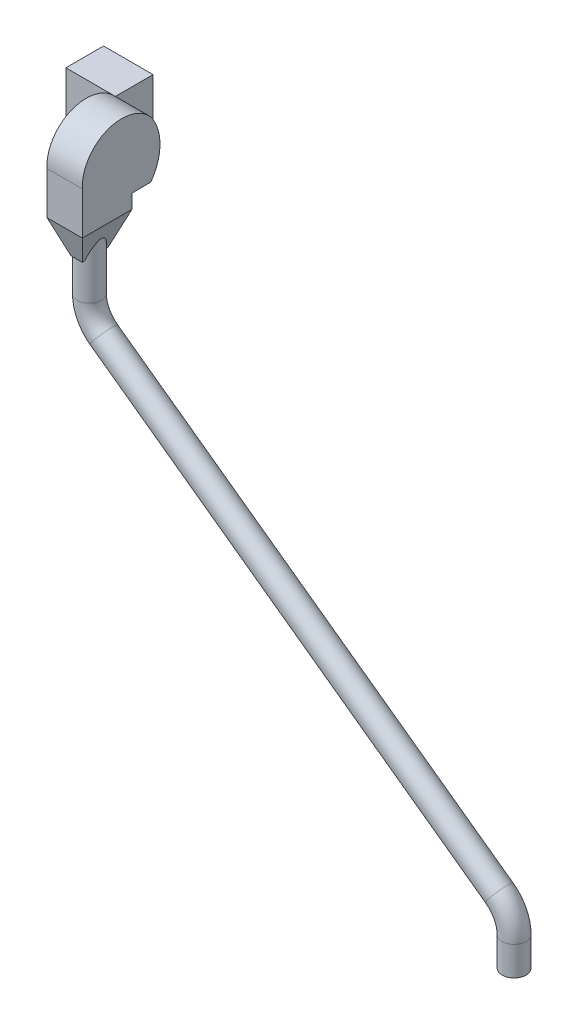
ISO-10303-21;
HEADER;
FILE_DESCRIPTION(('STEP AP214'),'2;1');
FILE_NAME('part.step','',(''),(''),'','','');
FILE_SCHEMA(('AUTOMOTIVE_DESIGN { 1 0 10303 214 1 1 1 1 }'));
ENDSEC;
DATA;
#1=APPLICATION_CONTEXT('core data for automotive mechanical design processes');
#2=APPLICATION_PROTOCOL_DEFINITION('international standard','automotive_design',2000,#1);
#3=PRODUCT_CONTEXT('',#1,'mechanical');
#4=PRODUCT('Part','Part','',(#3));
#5=PRODUCT_RELATED_PRODUCT_CATEGORY('part','',(#4));
#6=PRODUCT_DEFINITION_FORMATION('','',#4);
#7=PRODUCT_DEFINITION_CONTEXT('part definition',#1,'design');
#8=PRODUCT_DEFINITION('design','',#6,#7);
#9=PRODUCT_DEFINITION_SHAPE('','',#8);
#10=(LENGTH_UNIT() NAMED_UNIT(*) SI_UNIT(.MILLI.,.METRE.));
#11=(NAMED_UNIT(*) PLANE_ANGLE_UNIT() SI_UNIT($,.RADIAN.));
#12=(NAMED_UNIT(*) SI_UNIT($,.STERADIAN.) SOLID_ANGLE_UNIT());
#13=UNCERTAINTY_MEASURE_WITH_UNIT(LENGTH_MEASURE(1.E-05),#10,'distance_accuracy_value','');
#14=(GEOMETRIC_REPRESENTATION_CONTEXT(3) GLOBAL_UNCERTAINTY_ASSIGNED_CONTEXT((#13)) GLOBAL_UNIT_ASSIGNED_CONTEXT((#10,
#11,#12)) REPRESENTATION_CONTEXT('',''));
#15=CARTESIAN_POINT('',(0.,0.,0.));
#16=DIRECTION('',(0.,0.,1.));
#17=DIRECTION('',(1.,0.,0.));
#18=AXIS2_PLACEMENT_3D('',#15,#16,#17);
#19=CARTESIAN_POINT('',(255.,-120.,160.));
#20=DIRECTION('',(0.,1.,0.));
#21=DIRECTION('',(0.,0.,1.));
#22=AXIS2_PLACEMENT_3D('',#19,#20,#21);
#23=PLANE('',#22);
#24=DIRECTION('',(1.,0.,0.));
#25=VECTOR('',#24,1.);
#26=CARTESIAN_POINT('',(255.,-120.,239.857858587835));
#27=LINE('',#26,#25);
#28=CARTESIAN_POINT('',(105.,-120.,239.857858587835));
#29=VERTEX_POINT('',#28);
#30=CARTESIAN_POINT('',(255.,-120.,239.857858587835));
#31=VERTEX_POINT('',#30);
#32=EDGE_CURVE('E141',#29,#31,#27,.T.);
#33=ORIENTED_EDGE('',*,*,#32,.F.);
#34=DIRECTION('',(0.,0.,-1.));
#35=VECTOR('',#34,1.);
#36=CARTESIAN_POINT('',(105.,-120.,160.));
#37=LINE('',#36,#35);
#38=CARTESIAN_POINT('',(105.,-120.,160.));
#39=VERTEX_POINT('',#38);
#40=EDGE_CURVE('E187',#29,#39,#37,.T.);
#41=ORIENTED_EDGE('',*,*,#40,.T.);
#42=DIRECTION('',(-1.,0.,0.));
#43=VECTOR('',#42,1.);
#44=CARTESIAN_POINT('',(255.,-120.,160.));
#45=LINE('',#44,#43);
#46=CARTESIAN_POINT('',(255.,-120.,160.));
#47=VERTEX_POINT('',#46);
#48=EDGE_CURVE('E193',#47,#39,#45,.T.);
#49=ORIENTED_EDGE('',*,*,#48,.F.);
#50=DIRECTION('',(0.,0.,-1.));
#51=VECTOR('',#50,1.);
#52=CARTESIAN_POINT('',(255.,-120.,160.));
#53=LINE('',#52,#51);
#54=EDGE_CURVE('E191',#31,#47,#53,.T.);
#55=ORIENTED_EDGE('',*,*,#54,.F.);
#56=EDGE_LOOP('',(#33,#41,#49,#55));
#57=FACE_BOUND('',#56,.T.);
#58=ADVANCED_FACE('F44',(#57),#23,.F.);
#59=CARTESIAN_POINT('',(255.,0.,324.123215286529));
#60=DIRECTION('',(-1.,0.,0.));
#61=DIRECTION('',(0.,0.,1.));
#62=AXIS2_PLACEMENT_3D('',#59,#60,#61);
#63=CYLINDRICAL_SURFACE('',#62,203.31362422619);
#64=CARTESIAN_POINT('',(105.,0.,324.123215286529));
#65=DIRECTION('',(1.,0.,0.));
#66=DIRECTION('',(0.,0.,-1.));
#67=AXIS2_PLACEMENT_3D('',#64,#65,#66);
#68=CIRCLE('',#67,203.31362422619);
#69=CARTESIAN_POINT('',(105.,120.,160.));
#70=VERTEX_POINT('',#69);
#71=EDGE_CURVE('E182',#39,#70,#68,.T.);
#72=ORIENTED_EDGE('',*,*,#71,.T.);
#73=DIRECTION('',(-1.,0.,0.));
#74=VECTOR('',#73,1.);
#75=CARTESIAN_POINT('',(255.,120.,160.));
#76=LINE('',#75,#74);
#77=CARTESIAN_POINT('',(255.,120.,160.));
#78=VERTEX_POINT('',#77);
#79=EDGE_CURVE('E207',#78,#70,#76,.T.);
#80=ORIENTED_EDGE('',*,*,#79,.F.);
#81=CARTESIAN_POINT('',(255.,0.,324.123215286529));
#82=DIRECTION('',(1.,0.,0.));
#83=DIRECTION('',(0.,0.,-1.));
#84=AXIS2_PLACEMENT_3D('',#81,#82,#83);
#85=CIRCLE('',#84,203.31362422619);
#86=EDGE_CURVE('E183',#47,#78,#85,.T.);
#87=ORIENTED_EDGE('',*,*,#86,.F.);
#88=ORIENTED_EDGE('',*,*,#48,.T.);
#89=EDGE_LOOP('',(#72,#80,#87,#88));
#90=FACE_BOUND('',#89,.T.);
#91=ADVANCED_FACE('F46',(#90),#63,.T.);
#92=CARTESIAN_POINT('',(255.,8.53871556863522,283.705675407711));
#93=DIRECTION('',(-1.,0.,0.));
#94=DIRECTION('',(0.,0.,1.));
#95=AXIS2_PLACEMENT_3D('',#92,#93,#94);
#96=CYLINDRICAL_SURFACE('',#95,166.513399025927);
#97=CARTESIAN_POINT('',(105.,8.53871556863522,283.705675407711));
#98=DIRECTION('',(1.,0.,0.));
#99=DIRECTION('',(0.,0.,1.));
#100=AXIS2_PLACEMENT_3D('',#97,#98,#99);
#101=CIRCLE('',#100,166.513399025927);
#102=CARTESIAN_POINT('',(105.,0.,450.));
#103=VERTEX_POINT('',#102);
#104=EDGE_CURVE('E196',#70,#103,#101,.T.);
#105=ORIENTED_EDGE('',*,*,#104,.T.);
#106=DIRECTION('',(-1.,0.,0.));
#107=VECTOR('',#106,1.);
#108=CARTESIAN_POINT('',(255.,0.,450.));
#109=LINE('',#108,#107);
#110=CARTESIAN_POINT('',(255.,0.,450.));
#111=VERTEX_POINT('',#110);
#112=EDGE_CURVE('E204',#111,#103,#109,.T.);
#113=ORIENTED_EDGE('',*,*,#112,.F.);
#114=CARTESIAN_POINT('',(255.,8.53871556863522,283.705675407711));
#115=DIRECTION('',(1.,0.,0.));
#116=DIRECTION('',(0.,0.,1.));
#117=AXIS2_PLACEMENT_3D('',#114,#115,#116);
#118=CIRCLE('',#117,166.513399025927);
#119=EDGE_CURVE('E186',#78,#111,#118,.T.);
#120=ORIENTED_EDGE('',*,*,#119,.F.);
#121=ORIENTED_EDGE('',*,*,#79,.T.);
#122=EDGE_LOOP('',(#105,#113,#120,#121));
#123=FACE_BOUND('',#122,.T.);
#124=ADVANCED_FACE('F238',(#123),#96,.T.);
#125=CARTESIAN_POINT('',(255.,-120.,450.));
#126=DIRECTION('',(0.,0.,-1.));
#127=DIRECTION('',(-1.,0.,0.));
#128=AXIS2_PLACEMENT_3D('',#125,#126,#127);
#129=PLANE('',#128);
#130=DIRECTION('',(0.,-1.,0.));
#131=VECTOR('',#130,1.);
#132=CARTESIAN_POINT('',(105.,-120.,450.));
#133=LINE('',#132,#131);
#134=CARTESIAN_POINT('',(105.,-180.,450.));
#135=VERTEX_POINT('',#134);
#136=EDGE_CURVE('E198',#103,#135,#133,.T.);
#137=ORIENTED_EDGE('',*,*,#136,.T.);
#138=DIRECTION('',(-1.,0.,0.));
#139=VECTOR('',#138,1.);
#140=CARTESIAN_POINT('',(105.,-180.,450.));
#141=LINE('',#140,#139);
#142=CARTESIAN_POINT('',(255.,-180.,450.));
#143=VERTEX_POINT('',#142);
#144=EDGE_CURVE('E171',#143,#135,#141,.T.);
#145=ORIENTED_EDGE('',*,*,#144,.F.);
#146=DIRECTION('',(0.,-1.,0.));
#147=VECTOR('',#146,1.);
#148=CARTESIAN_POINT('',(255.,-120.,450.));
#149=LINE('',#148,#147);
#150=EDGE_CURVE('E189',#111,#143,#149,.T.);
#151=ORIENTED_EDGE('',*,*,#150,.F.);
#152=ORIENTED_EDGE('',*,*,#112,.T.);
#153=EDGE_LOOP('',(#137,#145,#151,#152));
#154=FACE_BOUND('',#153,.T.);
#155=ADVANCED_FACE('F234',(#154),#129,.F.);
#156=CARTESIAN_POINT('',(255.,0.,324.123215286529));
#157=DIRECTION('',(1.,0.,0.));
#158=DIRECTION('',(0.,0.,-1.));
#159=AXIS2_PLACEMENT_3D('',#156,#157,#158);
#160=PLANE('',#159);
#161=ORIENTED_EDGE('',*,*,#86,.T.);
#162=ORIENTED_EDGE('',*,*,#119,.T.);
#163=ORIENTED_EDGE('',*,*,#150,.T.);
#164=DIRECTION('',(0.,0.,1.));
#165=VECTOR('',#164,1.);
#166=CARTESIAN_POINT('',(255.,-180.,450.));
#167=LINE('',#166,#165);
#168=CARTESIAN_POINT('',(255.,-180.,239.857858587835));
#169=VERTEX_POINT('',#168);
#170=EDGE_CURVE('E168',#169,#143,#167,.T.);
#171=ORIENTED_EDGE('',*,*,#170,.F.);
#172=DIRECTION('',(0.,1.,0.));
#173=VECTOR('',#172,1.);
#174=CARTESIAN_POINT('',(255.,-180.,239.857858587835));
#175=LINE('',#174,#173);
#176=EDGE_CURVE('E174',#169,#31,#175,.T.);
#177=ORIENTED_EDGE('',*,*,#176,.T.);
#178=ORIENTED_EDGE('',*,*,#54,.T.);
#179=EDGE_LOOP('',(#161,#162,#163,#171,#177,#178));
#180=FACE_BOUND('',#179,.T.);
#181=ADVANCED_FACE('F248',(#180),#160,.T.);
#182=CARTESIAN_POINT('',(105.,0.,324.123215286529));
#183=DIRECTION('',(1.,0.,0.));
#184=DIRECTION('',(0.,0.,-1.));
#185=AXIS2_PLACEMENT_3D('',#182,#183,#184);
#186=PLANE('',#185);
#187=ORIENTED_EDGE('',*,*,#71,.F.);
#188=ORIENTED_EDGE('',*,*,#40,.F.);
#189=DIRECTION('',(0.,1.,0.));
#190=VECTOR('',#189,1.);
#191=CARTESIAN_POINT('',(105.,-180.,239.857858587835));
#192=LINE('',#191,#190);
#193=CARTESIAN_POINT('',(105.,-180.,239.857858587835));
#194=VERTEX_POINT('',#193);
#195=EDGE_CURVE('E179',#194,#29,#192,.T.);
#196=ORIENTED_EDGE('',*,*,#195,.F.);
#197=DIRECTION('',(0.,0.,-1.));
#198=VECTOR('',#197,1.);
#199=CARTESIAN_POINT('',(105.,-180.,239.857858587835));
#200=LINE('',#199,#198);
#201=EDGE_CURVE('E162',#135,#194,#200,.T.);
#202=ORIENTED_EDGE('',*,*,#201,.F.);
#203=ORIENTED_EDGE('',*,*,#136,.F.);
#204=ORIENTED_EDGE('',*,*,#104,.F.);
#205=EDGE_LOOP('',(#187,#188,#196,#202,#203,#204));
#206=FACE_BOUND('',#205,.T.);
#207=ADVANCED_FACE('F231',(#206),#186,.F.);
#208=CARTESIAN_POINT('',(255.,-180.,239.857858587835));
#209=DIRECTION('',(0.,0.,1.));
#210=DIRECTION('',(0.,-1.,0.));
#211=AXIS2_PLACEMENT_3D('',#208,#209,#210);
#212=PLANE('',#211);
#213=ORIENTED_EDGE('',*,*,#32,.T.);
#214=ORIENTED_EDGE('',*,*,#176,.F.);
#215=DIRECTION('',(1.,0.,0.));
#216=VECTOR('',#215,1.);
#217=CARTESIAN_POINT('',(255.,-180.,239.857858587835));
#218=LINE('',#217,#216);
#219=EDGE_CURVE('E165',#194,#169,#218,.T.);
#220=ORIENTED_EDGE('',*,*,#219,.F.);
#221=ORIENTED_EDGE('',*,*,#195,.T.);
#222=EDGE_LOOP('',(#213,#214,#220,#221));
#223=FACE_BOUND('',#222,.T.);
#224=ADVANCED_FACE('F245',(#223),#212,.F.);
#225=CARTESIAN_POINT('',(0.,-320.,0.));
#226=DIRECTION('',(0.,1.,0.));
#227=DIRECTION('',(0.,0.,1.));
#228=AXIS2_PLACEMENT_3D('',#225,#226,#227);
#229=PLANE('',#228);
#230=DIRECTION('',(0.,0.,-1.));
#231=VECTOR('',#230,1.);
#232=CARTESIAN_POINT('',(204.044167202732,-320.,0.));
#233=LINE('',#232,#231);
#234=CARTESIAN_POINT('',(204.044167202732,-320.,290.813691385104));
#235=VERTEX_POINT('',#234);
#236=CARTESIAN_POINT('',(204.044167202732,-320.,300.179426240508));
#237=VERTEX_POINT('',#236);
#238=EDGE_CURVE('E158',#235,#237,#233,.F.);
#239=ORIENTED_EDGE('',*,*,#238,.T.);
#240=CARTESIAN_POINT('',(180.,-320.,344.928929293918));
#241=DIRECTION('',(0.,1.,0.));
#242=DIRECTION('',(0.,0.,1.));
#243=AXIS2_PLACEMENT_3D('',#240,#241,#242);
#244=CIRCLE('',#243,50.8);
#245=CARTESIAN_POINT('',(155.955832797268,-320.,300.179426240508));
#246=VERTEX_POINT('',#245);
#247=EDGE_CURVE('E12',#237,#246,#244,.T.);
#248=ORIENTED_EDGE('',*,*,#247,.T.);
#249=DIRECTION('',(0.,0.,1.));
#250=VECTOR('',#249,1.);
#251=CARTESIAN_POINT('',(155.955832797268,-320.,0.));
#252=LINE('',#251,#250);
#253=CARTESIAN_POINT('',(155.955832797268,-320.,290.813691385104));
#254=VERTEX_POINT('',#253);
#255=EDGE_CURVE('E137',#246,#254,#252,.F.);
#256=ORIENTED_EDGE('',*,*,#255,.T.);
#257=DIRECTION('',(-1.,0.,0.));
#258=VECTOR('',#257,1.);
#259=CARTESIAN_POINT('',(0.,-320.,290.813691385104));
#260=LINE('',#259,#258);
#261=EDGE_CURVE('E155',#254,#235,#260,.F.);
#262=ORIENTED_EDGE('',*,*,#261,.T.);
#263=EDGE_LOOP('',(#239,#248,#256,#262));
#264=FACE_BOUND('',#263,.T.);
#265=ADVANCED_FACE('F255',(#264),#229,.F.);
#266=CARTESIAN_POINT('',(105.,-180.,239.857858587835));
#267=DIRECTION('',(-0.939692620785908,-0.342020143325669,0.));
#268=DIRECTION('',(0.342020143325669,-0.939692620785908,0.));
#269=AXIS2_PLACEMENT_3D('',#266,#267,#268);
#270=PLANE('',#269);
#271=ORIENTED_EDGE('',*,*,#255,.F.);
#272=CARTESIAN_POINT('',(180.,-386.060806459097,344.928929293918));
#273=DIRECTION('',(-0.939692620785908,-0.342020143325669,0.));
#274=DIRECTION('',(-0.342020143325669,0.939692620785908,0.));
#275=AXIS2_PLACEMENT_3D('',#272,#273,#274);
#276=ELLIPSE('',#275,148.529263528285,50.8);
#277=CARTESIAN_POINT('',(155.955832797268,-320.,389.678432347327));
#278=VERTEX_POINT('',#277);
#279=EDGE_CURVE('E48',#246,#278,#276,.F.);
#280=ORIENTED_EDGE('',*,*,#279,.T.);
#281=CARTESIAN_POINT('',(155.955832797268,-320.,399.044167202732));
#282=VERTEX_POINT('',#281);
#283=EDGE_CURVE('E152',#282,#278,#252,.F.);
#284=ORIENTED_EDGE('',*,*,#283,.F.);
#285=DIRECTION('',(-0.323615577118185,0.889126490715988,0.323615577118185));
#286=VECTOR('',#285,1.);
#287=CARTESIAN_POINT('',(127.007564817849,-240.465287394225,427.992435182151));
#288=LINE('',#287,#286);
#289=EDGE_CURVE('E143',#282,#135,#288,.T.);
#290=ORIENTED_EDGE('',*,*,#289,.T.);
#291=ORIENTED_EDGE('',*,*,#201,.T.);
#292=DIRECTION('',(-0.323615577118185,0.889126490715988,-0.323615577118185));
#293=VECTOR('',#292,1.);
#294=CARTESIAN_POINT('',(120.70905626303,-223.160277363618,255.566914850866));
#295=LINE('',#294,#293);
#296=EDGE_CURVE('E138',#254,#194,#295,.T.);
#297=ORIENTED_EDGE('',*,*,#296,.F.);
#298=EDGE_LOOP('',(#271,#280,#284,#290,#291,#297));
#299=FACE_BOUND('',#298,.T.);
#300=ADVANCED_FACE('F217',(#299),#270,.T.);
#301=CARTESIAN_POINT('',(255.,-180.,239.857858587835));
#302=DIRECTION('',(0.,-0.342020143325669,-0.939692620785908));
#303=DIRECTION('',(0.,0.939692620785908,-0.342020143325669));
#304=AXIS2_PLACEMENT_3D('',#301,#302,#303);
#305=PLANE('',#304);
#306=ORIENTED_EDGE('',*,*,#219,.T.);
#307=DIRECTION('',(0.323615577118185,0.889126490715988,-0.323615577118185));
#308=VECTOR('',#307,1.);
#309=CARTESIAN_POINT('',(232.992435182151,-240.465287394225,261.865423405684));
#310=LINE('',#309,#308);
#311=EDGE_CURVE('E142',#235,#169,#310,.T.);
#312=ORIENTED_EDGE('',*,*,#311,.F.);
#313=ORIENTED_EDGE('',*,*,#261,.F.);
#314=ORIENTED_EDGE('',*,*,#296,.T.);
#315=EDGE_LOOP('',(#306,#312,#313,#314));
#316=FACE_BOUND('',#315,.T.);
#317=ADVANCED_FACE('F251',(#316),#305,.T.);
#318=CARTESIAN_POINT('',(255.,-180.,450.));
#319=DIRECTION('',(0.939692620785908,-0.342020143325669,0.));
#320=DIRECTION('',(0.342020143325669,0.939692620785908,0.));
#321=AXIS2_PLACEMENT_3D('',#318,#319,#320);
#322=PLANE('',#321);
#323=CARTESIAN_POINT('',(204.044167202732,-320.,389.678432347327));
#324=VERTEX_POINT('',#323);
#325=CARTESIAN_POINT('',(204.044167202732,-320.,399.044167202732));
#326=VERTEX_POINT('',#325);
#327=EDGE_CURVE('E157',#324,#326,#233,.F.);
#328=ORIENTED_EDGE('',*,*,#327,.F.);
#329=CARTESIAN_POINT('',(180.,-386.060806459097,344.928929293918));
#330=DIRECTION('',(0.939692620785908,-0.342020143325669,0.));
#331=DIRECTION('',(0.342020143325669,0.939692620785908,0.));
#332=AXIS2_PLACEMENT_3D('',#329,#330,#331);
#333=ELLIPSE('',#332,148.529263528285,50.8);
#334=EDGE_CURVE('E210',#324,#237,#333,.F.);
#335=ORIENTED_EDGE('',*,*,#334,.T.);
#336=ORIENTED_EDGE('',*,*,#238,.F.);
#337=ORIENTED_EDGE('',*,*,#311,.T.);
#338=ORIENTED_EDGE('',*,*,#170,.T.);
#339=DIRECTION('',(0.323615577118185,0.889126490715988,0.323615577118185));
#340=VECTOR('',#339,1.);
#341=CARTESIAN_POINT('',(239.29094373697,-223.160277363618,434.29094373697));
#342=LINE('',#341,#340);
#343=EDGE_CURVE('E146',#326,#143,#342,.T.);
#344=ORIENTED_EDGE('',*,*,#343,.F.);
#345=EDGE_LOOP('',(#328,#335,#336,#337,#338,#344));
#346=FACE_BOUND('',#345,.T.);
#347=ADVANCED_FACE('F253',(#346),#322,.T.);
#348=CARTESIAN_POINT('',(105.,-180.,450.));
#349=DIRECTION('',(0.,-0.342020143325669,0.939692620785908));
#350=DIRECTION('',(0.,-0.939692620785908,-0.342020143325669));
#351=AXIS2_PLACEMENT_3D('',#348,#349,#350);
#352=PLANE('',#351);
#353=ORIENTED_EDGE('',*,*,#144,.T.);
#354=ORIENTED_EDGE('',*,*,#289,.F.);
#355=DIRECTION('',(1.,0.,0.));
#356=VECTOR('',#355,1.);
#357=CARTESIAN_POINT('',(0.,-320.,399.044167202732));
#358=LINE('',#357,#356);
#359=EDGE_CURVE('E147',#326,#282,#358,.F.);
#360=ORIENTED_EDGE('',*,*,#359,.F.);
#361=ORIENTED_EDGE('',*,*,#343,.T.);
#362=EDGE_LOOP('',(#353,#354,#360,#361));
#363=FACE_BOUND('',#362,.T.);
#364=ADVANCED_FACE('F225',(#363),#352,.T.);
#365=ORIENTED_EDGE('',*,*,#283,.T.);
#366=EDGE_CURVE('E54',#278,#324,#244,.T.);
#367=ORIENTED_EDGE('',*,*,#366,.T.);
#368=ORIENTED_EDGE('',*,*,#327,.T.);
#369=ORIENTED_EDGE('',*,*,#359,.T.);
#370=EDGE_LOOP('',(#365,#367,#368,#369));
#371=FACE_BOUND('',#370,.T.);
#372=ADVANCED_FACE('F220',(#371),#229,.F.);
#373=CARTESIAN_POINT('',(180.,-350.,344.928929293918));
#374=DIRECTION('',(0.,1.,0.));
#375=DIRECTION('',(0.,0.,1.));
#376=AXIS2_PLACEMENT_3D('',#373,#374,#375);
#377=CYLINDRICAL_SURFACE('',#376,50.8);
#378=ORIENTED_EDGE('',*,*,#247,.F.);
#379=ORIENTED_EDGE('',*,*,#334,.F.);
#380=ORIENTED_EDGE('',*,*,#366,.F.);
#381=ORIENTED_EDGE('',*,*,#279,.F.);
#382=EDGE_LOOP('',(#378,#379,#380,#381));
#383=FACE_BOUND('',#382,.T.);
#384=CARTESIAN_POINT('',(179.999999999999,-473.303305740213,344.928929293918));
#385=DIRECTION('',(0.,-1.,0.));
#386=DIRECTION('',(0.,0.,-1.));
#387=AXIS2_PLACEMENT_3D('',#384,#385,#386);
#388=CIRCLE('',#387,50.8);
#389=CARTESIAN_POINT('',(129.2,-473.303305740214,344.928929293918));
#390=VERTEX_POINT('',#389);
#391=EDGE_CURVE('E134',#390,#390,#388,.T.);
#392=ORIENTED_EDGE('',*,*,#391,.F.);
#393=EDGE_LOOP('',(#392));
#394=FACE_BOUND('',#393,.T.);
#395=ADVANCED_FACE('F266',(#383,#394),#377,.T.);
#396=CARTESIAN_POINT('',(1980.,-2050.,344.928929293918));
#397=DIRECTION('',(0.,-1.,0.));
#398=DIRECTION('',(0.,0.,-1.));
#399=AXIS2_PLACEMENT_3D('',#396,#397,#398);
#400=PLANE('',#399);
#401=CARTESIAN_POINT('',(1980.,-2050.,344.928929293918));
#402=DIRECTION('',(0.,-1.,0.));
#403=DIRECTION('',(0.,0.,-1.));
#404=AXIS2_PLACEMENT_3D('',#401,#402,#403);
#405=CIRCLE('',#404,50.8);
#406=CARTESIAN_POINT('',(1980.,-2050.,294.128929293918));
#407=VERTEX_POINT('',#406);
#408=EDGE_CURVE('E120',#407,#407,#405,.T.);
#409=ORIENTED_EDGE('',*,*,#408,.T.);
#410=EDGE_LOOP('',(#409));
#411=FACE_BOUND('',#410,.T.);
#412=ADVANCED_FACE('F354',(#411),#400,.T.);
#413=CARTESIAN_POINT('',(1980.,-2050.,344.928929293918));
#414=DIRECTION('',(0.,1.,0.));
#415=DIRECTION('',(0.,0.,1.));
#416=AXIS2_PLACEMENT_3D('',#413,#414,#415);
#417=CYLINDRICAL_SURFACE('',#416,50.8);
#418=CARTESIAN_POINT('',(1980.,-1926.69669425979,344.928929293918));
#419=DIRECTION('',(0.,-1.,0.));
#420=DIRECTION('',(0.,0.,-1.));
#421=AXIS2_PLACEMENT_3D('',#418,#419,#420);
#422=CIRCLE('',#421,50.8);
#423=CARTESIAN_POINT('',(2030.8,-1926.69669425979,344.928929293918));
#424=VERTEX_POINT('',#423);
#425=EDGE_CURVE('E123',#424,#424,#422,.T.);
#426=ORIENTED_EDGE('',*,*,#425,.T.);
#427=EDGE_LOOP('',(#426));
#428=FACE_BOUND('',#427,.T.);
#429=ORIENTED_EDGE('',*,*,#408,.F.);
#430=EDGE_LOOP('',(#429));
#431=FACE_BOUND('',#430,.T.);
#432=ADVANCED_FACE('F121',(#428,#431),#417,.T.);
#433=CARTESIAN_POINT('',(1830.,-1926.69669425979,344.928929293918));
#434=DIRECTION('',(0.,0.,1.));
#435=DIRECTION('',(1.,0.,0.));
#436=AXIS2_PLACEMENT_3D('',#433,#434,#435);
#437=TOROIDAL_SURFACE('',#436,149.999999999999,50.8);
#438=CARTESIAN_POINT('',(1917.82358307665,-1805.09480999981,344.928929293918));
#439=DIRECTION('',(0.810679228399882,-0.585490553844357,0.));
#440=DIRECTION('',(0.,0.,-1.));
#441=AXIS2_PLACEMENT_3D('',#438,#439,#440);
#442=CIRCLE('',#441,50.8);
#443=CARTESIAN_POINT('',(1947.56650321195,-1763.91230519709,344.928929293918));
#444=VERTEX_POINT('',#443);
#445=EDGE_CURVE('E126',#444,#444,#442,.T.);
#446=CARTESIAN_POINT('',(1830.,-1926.69669425979,344.928929293918));
#447=DIRECTION('',(0.,0.,1.));
#448=DIRECTION('',(1.,0.,0.));
#449=AXIS2_PLACEMENT_3D('',#446,#447,#448);
#450=CIRCLE('',#449,200.799999999999);
#451=EDGE_CURVE('',#424,#444,#450,.T.);
#452=ORIENTED_EDGE('',*,*,#425,.F.);
#453=ORIENTED_EDGE('',*,*,#445,.T.);
#454=ORIENTED_EDGE('',*,*,#451,.T.);
#455=ORIENTED_EDGE('',*,*,#451,.F.);
#456=EDGE_LOOP('',(#452,#454,#453,#455));
#457=FACE_BOUND('',#456,.T.);
#458=ADVANCED_FACE('F372',(#457),#437,.T.);
#459=CARTESIAN_POINT('',(1917.82358307665,-1805.09480999981,344.928929293918));
#460=DIRECTION('',(-0.810679228399881,0.585490553844358,0.));
#461=DIRECTION('',(-0.585490553844359,-0.810679228399881,0.));
#462=AXIS2_PLACEMENT_3D('',#459,#460,#461);
#463=CYLINDRICAL_SURFACE('',#462,50.8);
#464=CARTESIAN_POINT('',(242.176416923346,-594.905190000195,344.928929293918));
#465=DIRECTION('',(0.810679228399882,-0.585490553844358,0.));
#466=DIRECTION('',(0.,0.,-1.));
#467=AXIS2_PLACEMENT_3D('',#464,#465,#466);
#468=CIRCLE('',#467,50.8);
#469=CARTESIAN_POINT('',(212.433496788053,-636.087694802909,344.928929293918));
#470=VERTEX_POINT('',#469);
#471=EDGE_CURVE('E131',#470,#470,#468,.T.);
#472=ORIENTED_EDGE('',*,*,#471,.T.);
#473=EDGE_LOOP('',(#472));
#474=FACE_BOUND('',#473,.T.);
#475=ORIENTED_EDGE('',*,*,#445,.F.);
#476=EDGE_LOOP('',(#475));
#477=FACE_BOUND('',#476,.T.);
#478=ADVANCED_FACE('F383',(#474,#477),#463,.T.);
#479=CARTESIAN_POINT('',(330.,-473.303305740212,344.928929293918));
#480=DIRECTION('',(0.,0.,-1.));
#481=DIRECTION('',(-1.,0.,0.));
#482=AXIS2_PLACEMENT_3D('',#479,#480,#481);
#483=TOROIDAL_SURFACE('',#482,150.,50.8);
#484=CARTESIAN_POINT('',(330.,-473.303305740212,344.928929293918));
#485=DIRECTION('',(0.,0.,-1.));
#486=DIRECTION('',(-1.,0.,0.));
#487=AXIS2_PLACEMENT_3D('',#484,#485,#486);
#488=CIRCLE('',#487,200.8);
#489=EDGE_CURVE('',#470,#390,#488,.T.);
#490=ORIENTED_EDGE('',*,*,#471,.F.);
#491=ORIENTED_EDGE('',*,*,#391,.T.);
#492=ORIENTED_EDGE('',*,*,#489,.T.);
#493=ORIENTED_EDGE('',*,*,#489,.F.);
#494=EDGE_LOOP('',(#490,#492,#491,#493));
#495=FACE_BOUND('',#494,.T.);
#496=ADVANCED_FACE('F356',(#495),#483,.T.);
#497=CLOSED_SHELL('',(#58,#91,#124,#155,#181,#207,#224,#265,#300,#317,#347,#364,#372,#395,#412,
#432,#458,#478,#496));
#498=MANIFOLD_SOLID_BREP('B2',#497);
#499=CARTESIAN_POINT('',(105.,-120.,160.));
#500=DIRECTION('',(-1.,0.,0.));
#501=DIRECTION('',(0.,0.,1.));
#502=AXIS2_PLACEMENT_3D('',#499,#500,#501);
#503=PLANE('',#502);
#504=DIRECTION('',(0.,1.,0.));
#505=VECTOR('',#504,1.);
#506=CARTESIAN_POINT('',(105.,-120.,0.));
#507=LINE('',#506,#505);
#508=CARTESIAN_POINT('',(105.,-120.,0.));
#509=VERTEX_POINT('',#508);
#510=CARTESIAN_POINT('',(105.,120.,0.));
#511=VERTEX_POINT('',#510);
#512=EDGE_CURVE('E526',#509,#511,#507,.T.);
#513=ORIENTED_EDGE('',*,*,#512,.T.);
#514=DIRECTION('',(0.,0.,-1.));
#515=VECTOR('',#514,1.);
#516=CARTESIAN_POINT('',(105.,120.,160.));
#517=LINE('',#516,#515);
#518=CARTESIAN_POINT('',(105.,120.,160.));
#519=VERTEX_POINT('',#518);
#520=EDGE_CURVE('E42',#519,#511,#517,.T.);
#521=ORIENTED_EDGE('',*,*,#520,.F.);
#522=DIRECTION('',(0.,1.,0.));
#523=VECTOR('',#522,1.);
#524=CARTESIAN_POINT('',(105.,-120.,160.));
#525=LINE('',#524,#523);
#526=CARTESIAN_POINT('',(105.,-120.,160.));
#527=VERTEX_POINT('',#526);
#528=EDGE_CURVE('E514',#527,#519,#525,.T.);
#529=ORIENTED_EDGE('',*,*,#528,.F.);
#530=DIRECTION('',(0.,0.,-1.));
#531=VECTOR('',#530,1.);
#532=CARTESIAN_POINT('',(105.,-120.,160.));
#533=LINE('',#532,#531);
#534=EDGE_CURVE('E522',#527,#509,#533,.T.);
#535=ORIENTED_EDGE('',*,*,#534,.T.);
#536=EDGE_LOOP('',(#513,#521,#529,#535));
#537=FACE_BOUND('',#536,.T.);
#538=ADVANCED_FACE('F463',(#537),#503,.F.);
#539=CARTESIAN_POINT('',(-105.,120.,160.));
#540=DIRECTION('',(0.,-1.,0.));
#541=DIRECTION('',(0.,0.,-1.));
#542=AXIS2_PLACEMENT_3D('',#539,#540,#541);
#543=PLANE('',#542);
#544=DIRECTION('',(-1.,0.,0.));
#545=VECTOR('',#544,1.);
#546=CARTESIAN_POINT('',(-105.,120.,0.));
#547=LINE('',#546,#545);
#548=CARTESIAN_POINT('',(-105.,120.,0.));
#549=VERTEX_POINT('',#548);
#550=EDGE_CURVE('E518',#511,#549,#547,.T.);
#551=ORIENTED_EDGE('',*,*,#550,.T.);
#552=DIRECTION('',(0.,0.,-1.));
#553=VECTOR('',#552,1.);
#554=CARTESIAN_POINT('',(-105.,120.,160.));
#555=LINE('',#554,#553);
#556=CARTESIAN_POINT('',(-105.,120.,160.));
#557=VERTEX_POINT('',#556);
#558=EDGE_CURVE('E471',#557,#549,#555,.T.);
#559=ORIENTED_EDGE('',*,*,#558,.F.);
#560=DIRECTION('',(-1.,0.,0.));
#561=VECTOR('',#560,1.);
#562=CARTESIAN_POINT('',(-105.,120.,160.));
#563=LINE('',#562,#561);
#564=EDGE_CURVE('E509',#519,#557,#563,.T.);
#565=ORIENTED_EDGE('',*,*,#564,.F.);
#566=ORIENTED_EDGE('',*,*,#520,.T.);
#567=EDGE_LOOP('',(#551,#559,#565,#566));
#568=FACE_BOUND('',#567,.T.);
#569=ADVANCED_FACE('F517',(#568),#543,.F.);
#570=CARTESIAN_POINT('',(-105.,-120.,160.));
#571=DIRECTION('',(1.,0.,0.));
#572=DIRECTION('',(0.,0.,-1.));
#573=AXIS2_PLACEMENT_3D('',#570,#571,#572);
#574=PLANE('',#573);
#575=DIRECTION('',(0.,-1.,0.));
#576=VECTOR('',#575,1.);
#577=CARTESIAN_POINT('',(-105.,-120.,0.));
#578=LINE('',#577,#576);
#579=CARTESIAN_POINT('',(-105.,-120.,0.));
#580=VERTEX_POINT('',#579);
#581=EDGE_CURVE('E496',#549,#580,#578,.T.);
#582=ORIENTED_EDGE('',*,*,#581,.T.);
#583=DIRECTION('',(0.,0.,-1.));
#584=VECTOR('',#583,1.);
#585=CARTESIAN_POINT('',(-105.,-120.,160.));
#586=LINE('',#585,#584);
#587=CARTESIAN_POINT('',(-105.,-120.,160.));
#588=VERTEX_POINT('',#587);
#589=EDGE_CURVE('E519',#588,#580,#586,.T.);
#590=ORIENTED_EDGE('',*,*,#589,.F.);
#591=DIRECTION('',(0.,-1.,0.));
#592=VECTOR('',#591,1.);
#593=CARTESIAN_POINT('',(-105.,-120.,160.));
#594=LINE('',#593,#592);
#595=EDGE_CURVE('E512',#557,#588,#594,.T.);
#596=ORIENTED_EDGE('',*,*,#595,.F.);
#597=ORIENTED_EDGE('',*,*,#558,.T.);
#598=EDGE_LOOP('',(#582,#590,#596,#597));
#599=FACE_BOUND('',#598,.T.);
#600=ADVANCED_FACE('F520',(#599),#574,.F.);
#601=CARTESIAN_POINT('',(-105.,-120.,160.));
#602=DIRECTION('',(0.,1.,0.));
#603=DIRECTION('',(0.,0.,1.));
#604=AXIS2_PLACEMENT_3D('',#601,#602,#603);
#605=PLANE('',#604);
#606=DIRECTION('',(1.,0.,0.));
#607=VECTOR('',#606,1.);
#608=CARTESIAN_POINT('',(-105.,-120.,0.));
#609=LINE('',#608,#607);
#610=EDGE_CURVE('E502',#580,#509,#609,.T.);
#611=ORIENTED_EDGE('',*,*,#610,.T.);
#612=ORIENTED_EDGE('',*,*,#534,.F.);
#613=DIRECTION('',(1.,0.,0.));
#614=VECTOR('',#613,1.);
#615=CARTESIAN_POINT('',(-105.,-120.,160.));
#616=LINE('',#615,#614);
#617=EDGE_CURVE('E479',#588,#527,#616,.T.);
#618=ORIENTED_EDGE('',*,*,#617,.F.);
#619=ORIENTED_EDGE('',*,*,#589,.T.);
#620=EDGE_LOOP('',(#611,#612,#618,#619));
#621=FACE_BOUND('',#620,.T.);
#622=ADVANCED_FACE('F533',(#621),#605,.F.);
#623=CARTESIAN_POINT('',(0.,0.,160.));
#624=DIRECTION('',(0.,0.,-1.));
#625=DIRECTION('',(-1.,0.,0.));
#626=AXIS2_PLACEMENT_3D('',#623,#624,#625);
#627=PLANE('',#626);
#628=ORIENTED_EDGE('',*,*,#528,.T.);
#629=ORIENTED_EDGE('',*,*,#564,.T.);
#630=ORIENTED_EDGE('',*,*,#595,.T.);
#631=ORIENTED_EDGE('',*,*,#617,.T.);
#632=EDGE_LOOP('',(#628,#629,#630,#631));
#633=FACE_BOUND('',#632,.T.);
#634=ADVANCED_FACE('F510',(#633),#627,.F.);
#635=CARTESIAN_POINT('',(0.,0.,0.));
#636=DIRECTION('',(0.,0.,-1.));
#637=DIRECTION('',(-1.,0.,0.));
#638=AXIS2_PLACEMENT_3D('',#635,#636,#637);
#639=PLANE('',#638);
#640=ORIENTED_EDGE('',*,*,#512,.F.);
#641=ORIENTED_EDGE('',*,*,#610,.F.);
#642=ORIENTED_EDGE('',*,*,#581,.F.);
#643=ORIENTED_EDGE('',*,*,#550,.F.);
#644=EDGE_LOOP('',(#640,#641,#642,#643));
#645=FACE_BOUND('',#644,.T.);
#646=ADVANCED_FACE('F536',(#645),#639,.T.);
#647=CLOSED_SHELL('',(#538,#569,#600,#622,#634,#646));
#648=MANIFOLD_SOLID_BREP('B6',#647);
#649=ADVANCED_BREP_SHAPE_REPRESENTATION('',(#18,#498,#648),#14);
#650=SHAPE_DEFINITION_REPRESENTATION(#9,#649);
ENDSEC;
END-ISO-10303-21;
